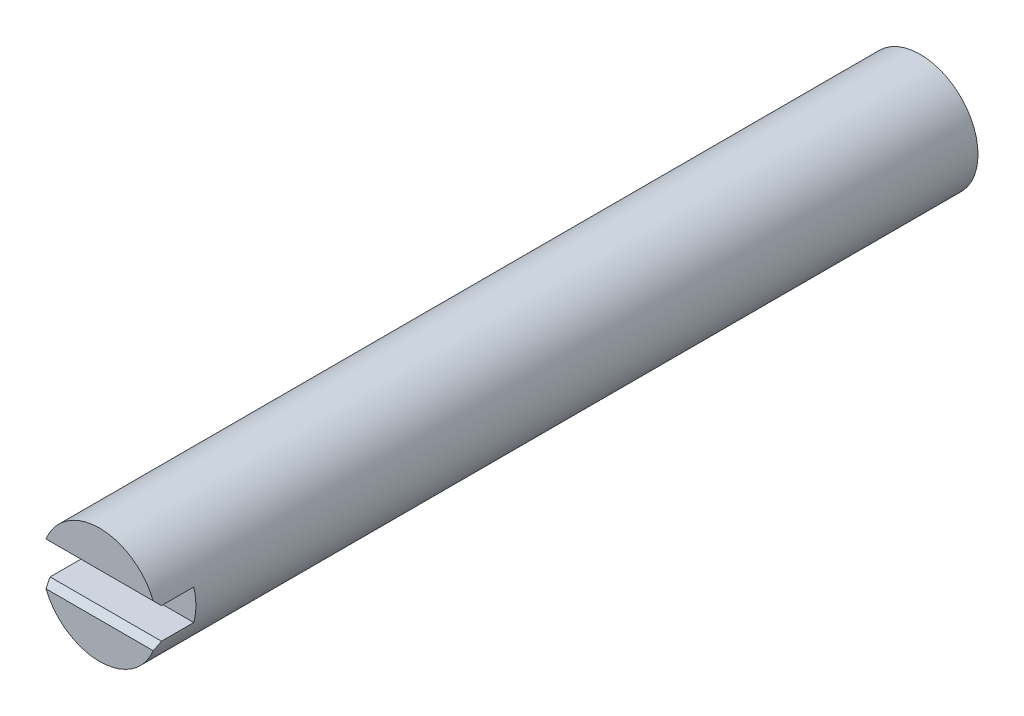
ISO-10303-21;
HEADER;
FILE_DESCRIPTION(('STEP AP214'),'2;1');
FILE_NAME('part.step','',(''),(''),'','','');
FILE_SCHEMA(('AUTOMOTIVE_DESIGN { 1 0 10303 214 1 1 1 1 }'));
ENDSEC;
DATA;
#1=APPLICATION_CONTEXT('core data for automotive mechanical design processes');
#2=APPLICATION_PROTOCOL_DEFINITION('international standard','automotive_design',2000,#1);
#3=PRODUCT_CONTEXT('',#1,'mechanical');
#4=PRODUCT('Part','Part','',(#3));
#5=PRODUCT_RELATED_PRODUCT_CATEGORY('part','',(#4));
#6=PRODUCT_DEFINITION_FORMATION('','',#4);
#7=PRODUCT_DEFINITION_CONTEXT('part definition',#1,'design');
#8=PRODUCT_DEFINITION('design','',#6,#7);
#9=PRODUCT_DEFINITION_SHAPE('','',#8);
#10=(LENGTH_UNIT() NAMED_UNIT(*) SI_UNIT(.MILLI.,.METRE.));
#11=(NAMED_UNIT(*) PLANE_ANGLE_UNIT() SI_UNIT($,.RADIAN.));
#12=(NAMED_UNIT(*) SI_UNIT($,.STERADIAN.) SOLID_ANGLE_UNIT());
#13=UNCERTAINTY_MEASURE_WITH_UNIT(LENGTH_MEASURE(1.E-05),#10,'distance_accuracy_value','');
#14=(GEOMETRIC_REPRESENTATION_CONTEXT(3) GLOBAL_UNCERTAINTY_ASSIGNED_CONTEXT((#13)) GLOBAL_UNIT_ASSIGNED_CONTEXT((#10,
#11,#12)) REPRESENTATION_CONTEXT('',''));
#15=CARTESIAN_POINT('',(0.,0.,0.));
#16=DIRECTION('',(0.,0.,1.));
#17=DIRECTION('',(1.,0.,0.));
#18=AXIS2_PLACEMENT_3D('',#15,#16,#17);
#19=CARTESIAN_POINT('',(0.,0.,0.));
#20=DIRECTION('',(0.,0.,1.));
#21=DIRECTION('',(1.,0.,0.));
#22=AXIS2_PLACEMENT_3D('',#19,#20,#21);
#23=PLANE('',#22);
#24=CARTESIAN_POINT('',(0.,0.,0.));
#25=DIRECTION('',(0.,0.,1.));
#26=DIRECTION('',(1.,0.,0.));
#27=AXIS2_PLACEMENT_3D('',#24,#25,#26);
#28=CIRCLE('',#27,4.7625);
#29=CARTESIAN_POINT('',(4.41815824184694,1.778,0.));
#30=VERTEX_POINT('',#29);
#31=CARTESIAN_POINT('',(-4.41815824184693,1.778,0.));
#32=VERTEX_POINT('',#31);
#33=EDGE_CURVE('E144',#30,#32,#28,.T.);
#34=ORIENTED_EDGE('',*,*,#33,.T.);
#35=DIRECTION('',(1.,0.,0.));
#36=VECTOR('',#35,1.);
#37=CARTESIAN_POINT('',(4.5900442535993,1.778,0.));
#38=LINE('',#37,#36);
#39=EDGE_CURVE('E11',#32,#30,#38,.T.);
#40=ORIENTED_EDGE('',*,*,#39,.T.);
#41=EDGE_LOOP('',(#34,#40));
#42=FACE_BOUND('',#41,.T.);
#43=ADVANCED_FACE('F44',(#42),#23,.T.);
#44=CARTESIAN_POINT('',(0.,0.,-67.6402));
#45=DIRECTION('',(0.,0.,1.));
#46=DIRECTION('',(1.,0.,0.));
#47=AXIS2_PLACEMENT_3D('',#44,#45,#46);
#48=CYLINDRICAL_SURFACE('',#47,4.7625);
#49=DIRECTION('',(0.,0.,1.));
#50=VECTOR('',#49,1.);
#51=CARTESIAN_POINT('',(4.5900442535993,-1.27,-67.6402));
#52=LINE('',#51,#50);
#53=CARTESIAN_POINT('',(4.5900442535993,-1.27,-0.508000000000008));
#54=VERTEX_POINT('',#53);
#55=CARTESIAN_POINT('',(4.5900442535993,-1.27,-3.175));
#56=VERTEX_POINT('',#55);
#57=EDGE_CURVE('E117',#54,#56,#52,.F.);
#58=ORIENTED_EDGE('',*,*,#57,.F.);
#59=CARTESIAN_POINT('',(0.,0.,-1.77800000000003));
#60=DIRECTION('',(0.,0.707106781186552,0.707106781186543));
#61=DIRECTION('',(0.,-0.707106781186543,0.707106781186552));
#62=AXIS2_PLACEMENT_3D('',#59,#60,#61);
#63=ELLIPSE('',#62,6.73519209080191,4.7625);
#64=CARTESIAN_POINT('',(4.41815824184693,-1.778,0.));
#65=VERTEX_POINT('',#64);
#66=EDGE_CURVE('E61',#54,#65,#63,.F.);
#67=ORIENTED_EDGE('',*,*,#66,.T.);
#68=CARTESIAN_POINT('',(-4.41815824184694,-1.778,0.));
#69=VERTEX_POINT('',#68);
#70=EDGE_CURVE('E139',#69,#65,#28,.T.);
#71=ORIENTED_EDGE('',*,*,#70,.F.);
#72=CARTESIAN_POINT('',(0.,0.,-1.77800000000003));
#73=DIRECTION('',(0.,0.707106781186552,0.707106781186543));
#74=DIRECTION('',(0.,-0.707106781186543,0.707106781186552));
#75=AXIS2_PLACEMENT_3D('',#72,#73,#74);
#76=ELLIPSE('',#75,6.73519209080191,4.7625);
#77=CARTESIAN_POINT('',(-4.5900442535993,-1.27,-0.508000000000008));
#78=VERTEX_POINT('',#77);
#79=EDGE_CURVE('E124',#69,#78,#76,.F.);
#80=ORIENTED_EDGE('',*,*,#79,.T.);
#81=DIRECTION('',(0.,0.,1.));
#82=VECTOR('',#81,1.);
#83=CARTESIAN_POINT('',(-4.5900442535993,-1.27,-67.6402));
#84=LINE('',#83,#82);
#85=CARTESIAN_POINT('',(-4.5900442535993,-1.27,-3.175));
#86=VERTEX_POINT('',#85);
#87=EDGE_CURVE('E115',#86,#78,#84,.T.);
#88=ORIENTED_EDGE('',*,*,#87,.F.);
#89=CARTESIAN_POINT('',(0.,0.,-3.175));
#90=DIRECTION('',(0.,0.,1.));
#91=DIRECTION('',(1.,0.,0.));
#92=AXIS2_PLACEMENT_3D('',#89,#90,#91);
#93=CIRCLE('',#92,4.7625);
#94=CARTESIAN_POINT('',(-4.5900442535993,1.27,-3.175));
#95=VERTEX_POINT('',#94);
#96=EDGE_CURVE('E99',#86,#95,#93,.F.);
#97=ORIENTED_EDGE('',*,*,#96,.T.);
#98=DIRECTION('',(0.,0.,1.));
#99=VECTOR('',#98,1.);
#100=CARTESIAN_POINT('',(-4.5900442535993,1.27,-67.6402));
#101=LINE('',#100,#99);
#102=CARTESIAN_POINT('',(-4.5900442535993,1.27,-0.508000000000008));
#103=VERTEX_POINT('',#102);
#104=EDGE_CURVE('E136',#103,#95,#101,.F.);
#105=ORIENTED_EDGE('',*,*,#104,.F.);
#106=CARTESIAN_POINT('',(0.,0.,-1.77800000000003));
#107=DIRECTION('',(0.,-0.707106781186552,0.707106781186543));
#108=DIRECTION('',(0.,0.707106781186543,0.707106781186552));
#109=AXIS2_PLACEMENT_3D('',#106,#107,#108);
#110=ELLIPSE('',#109,6.73519209080191,4.7625);
#111=EDGE_CURVE('E153',#103,#32,#110,.F.);
#112=ORIENTED_EDGE('',*,*,#111,.T.);
#113=ORIENTED_EDGE('',*,*,#33,.F.);
#114=CARTESIAN_POINT('',(0.,0.,-1.77800000000003));
#115=DIRECTION('',(0.,-0.707106781186552,0.707106781186543));
#116=DIRECTION('',(0.,0.707106781186543,0.707106781186552));
#117=AXIS2_PLACEMENT_3D('',#114,#115,#116);
#118=ELLIPSE('',#117,6.73519209080191,4.7625);
#119=CARTESIAN_POINT('',(4.5900442535993,1.27,-0.508000000000008));
#120=VERTEX_POINT('',#119);
#121=EDGE_CURVE('E150',#30,#120,#118,.F.);
#122=ORIENTED_EDGE('',*,*,#121,.T.);
#123=DIRECTION('',(0.,0.,1.));
#124=VECTOR('',#123,1.);
#125=CARTESIAN_POINT('',(4.5900442535993,1.27,-67.6402));
#126=LINE('',#125,#124);
#127=CARTESIAN_POINT('',(4.5900442535993,1.27,-3.175));
#128=VERTEX_POINT('',#127);
#129=EDGE_CURVE('E129',#128,#120,#126,.T.);
#130=ORIENTED_EDGE('',*,*,#129,.F.);
#131=EDGE_CURVE('E109',#128,#56,#93,.F.);
#132=ORIENTED_EDGE('',*,*,#131,.T.);
#133=EDGE_LOOP('',(#58,#67,#71,#80,#88,#97,#105,#112,#113,#122,#130,#132));
#134=FACE_BOUND('',#133,.T.);
#135=CARTESIAN_POINT('',(0.,0.,-67.6402));
#136=DIRECTION('',(0.,0.,1.));
#137=DIRECTION('',(1.,0.,0.));
#138=AXIS2_PLACEMENT_3D('',#135,#136,#137);
#139=CIRCLE('',#138,4.7625);
#140=CARTESIAN_POINT('',(4.7625,0.,-67.6402));
#141=VERTEX_POINT('',#140);
#142=EDGE_CURVE('E140',#141,#141,#139,.T.);
#143=ORIENTED_EDGE('',*,*,#142,.T.);
#144=EDGE_LOOP('',(#143));
#145=FACE_BOUND('',#144,.T.);
#146=ADVANCED_FACE('F121',(#134,#145),#48,.T.);
#147=CARTESIAN_POINT('',(0.,0.,-67.6402));
#148=DIRECTION('',(0.,0.,1.));
#149=DIRECTION('',(1.,0.,0.));
#150=AXIS2_PLACEMENT_3D('',#147,#148,#149);
#151=PLANE('',#150);
#152=ORIENTED_EDGE('',*,*,#142,.F.);
#153=EDGE_LOOP('',(#152));
#154=FACE_BOUND('',#153,.T.);
#155=ADVANCED_FACE('F186',(#154),#151,.F.);
#156=ORIENTED_EDGE('',*,*,#70,.T.);
#157=DIRECTION('',(-1.,0.,0.));
#158=VECTOR('',#157,1.);
#159=CARTESIAN_POINT('',(-4.5900442535993,-1.778,0.));
#160=LINE('',#159,#158);
#161=EDGE_CURVE('E67',#65,#69,#160,.T.);
#162=ORIENTED_EDGE('',*,*,#161,.T.);
#163=EDGE_LOOP('',(#156,#162));
#164=FACE_BOUND('',#163,.T.);
#165=ADVANCED_FACE('F182',(#164),#23,.T.);
#166=CARTESIAN_POINT('',(4.7625,1.27,-3.175));
#167=DIRECTION('',(0.,1.,0.));
#168=DIRECTION('',(0.,0.,1.));
#169=AXIS2_PLACEMENT_3D('',#166,#167,#168);
#170=PLANE('',#169);
#171=ORIENTED_EDGE('',*,*,#129,.T.);
#172=DIRECTION('',(-1.,0.,0.));
#173=VECTOR('',#172,1.);
#174=CARTESIAN_POINT('',(-4.5900442535993,1.27,-0.508000000000008));
#175=LINE('',#174,#173);
#176=EDGE_CURVE('E54',#120,#103,#175,.T.);
#177=ORIENTED_EDGE('',*,*,#176,.T.);
#178=ORIENTED_EDGE('',*,*,#104,.T.);
#179=DIRECTION('',(-1.,0.,0.));
#180=VECTOR('',#179,1.);
#181=CARTESIAN_POINT('',(4.7625,1.27,-3.175));
#182=LINE('',#181,#180);
#183=EDGE_CURVE('E104',#128,#95,#182,.T.);
#184=ORIENTED_EDGE('',*,*,#183,.F.);
#185=EDGE_LOOP('',(#171,#177,#178,#184));
#186=FACE_BOUND('',#185,.T.);
#187=ADVANCED_FACE('F165',(#186),#170,.F.);
#188=CARTESIAN_POINT('',(4.7625,-1.27,-3.175));
#189=DIRECTION('',(0.,-1.,0.));
#190=DIRECTION('',(0.,0.,-1.));
#191=AXIS2_PLACEMENT_3D('',#188,#189,#190);
#192=PLANE('',#191);
#193=ORIENTED_EDGE('',*,*,#87,.T.);
#194=DIRECTION('',(1.,0.,0.));
#195=VECTOR('',#194,1.);
#196=CARTESIAN_POINT('',(4.5900442535993,-1.27,-0.508000000000008));
#197=LINE('',#196,#195);
#198=EDGE_CURVE('E108',#78,#54,#197,.T.);
#199=ORIENTED_EDGE('',*,*,#198,.T.);
#200=ORIENTED_EDGE('',*,*,#57,.T.);
#201=DIRECTION('',(1.,0.,0.));
#202=VECTOR('',#201,1.);
#203=CARTESIAN_POINT('',(4.7625,-1.27,-3.175));
#204=LINE('',#203,#202);
#205=EDGE_CURVE('E102',#86,#56,#204,.T.);
#206=ORIENTED_EDGE('',*,*,#205,.F.);
#207=EDGE_LOOP('',(#193,#199,#200,#206));
#208=FACE_BOUND('',#207,.T.);
#209=ADVANCED_FACE('F113',(#208),#192,.F.);
#210=CARTESIAN_POINT('',(0.,0.,-3.175));
#211=DIRECTION('',(0.,0.,1.));
#212=DIRECTION('',(1.,0.,0.));
#213=AXIS2_PLACEMENT_3D('',#210,#211,#212);
#214=PLANE('',#213);
#215=ORIENTED_EDGE('',*,*,#205,.T.);
#216=ORIENTED_EDGE('',*,*,#131,.F.);
#217=ORIENTED_EDGE('',*,*,#183,.T.);
#218=ORIENTED_EDGE('',*,*,#96,.F.);
#219=EDGE_LOOP('',(#215,#216,#217,#218));
#220=FACE_BOUND('',#219,.T.);
#221=ADVANCED_FACE('F101',(#220),#214,.T.);
#222=CARTESIAN_POINT('',(4.7625,-1.27,-0.508000000000008));
#223=DIRECTION('',(0.,0.707106781186552,0.707106781186543));
#224=DIRECTION('',(-1.,0.,0.));
#225=AXIS2_PLACEMENT_3D('',#222,#223,#224);
#226=PLANE('',#225);
#227=ORIENTED_EDGE('',*,*,#79,.F.);
#228=ORIENTED_EDGE('',*,*,#161,.F.);
#229=ORIENTED_EDGE('',*,*,#66,.F.);
#230=ORIENTED_EDGE('',*,*,#198,.F.);
#231=EDGE_LOOP('',(#227,#228,#229,#230));
#232=FACE_BOUND('',#231,.T.);
#233=ADVANCED_FACE('F175',(#232),#226,.T.);
#234=CARTESIAN_POINT('',(4.7625,1.27,-0.508000000000008));
#235=DIRECTION('',(0.,-0.707106781186552,0.707106781186543));
#236=DIRECTION('',(1.,0.,0.));
#237=AXIS2_PLACEMENT_3D('',#234,#235,#236);
#238=PLANE('',#237);
#239=ORIENTED_EDGE('',*,*,#121,.F.);
#240=ORIENTED_EDGE('',*,*,#39,.F.);
#241=ORIENTED_EDGE('',*,*,#111,.F.);
#242=ORIENTED_EDGE('',*,*,#176,.F.);
#243=EDGE_LOOP('',(#239,#240,#241,#242));
#244=FACE_BOUND('',#243,.T.);
#245=ADVANCED_FACE('F47',(#244),#238,.T.);
#246=CLOSED_SHELL('',(#43,#146,#155,#165,#187,#209,#221,#233,#245));
#247=MANIFOLD_SOLID_BREP('B2',#246);
#248=ADVANCED_BREP_SHAPE_REPRESENTATION('',(#18,#247),#14);
#249=SHAPE_DEFINITION_REPRESENTATION(#9,#248);
ENDSEC;
END-ISO-10303-21;
